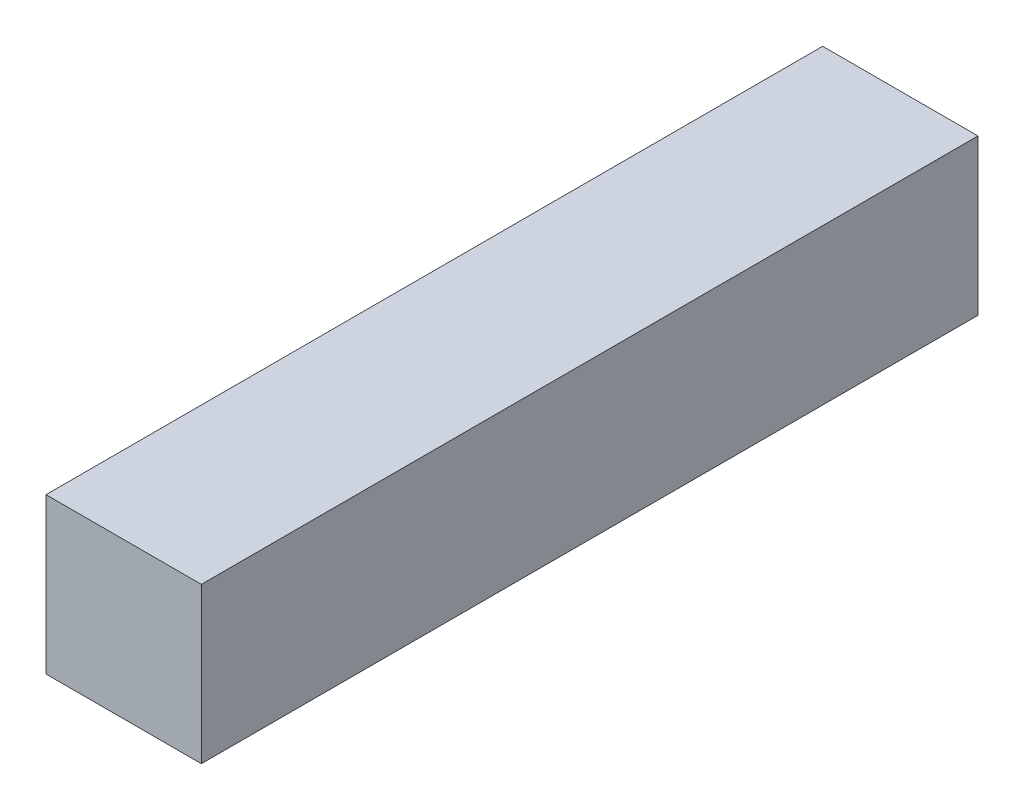
ISO-10303-21;
HEADER;
FILE_DESCRIPTION(('STEP AP214'),'2;1');
FILE_NAME('part.step','',(''),(''),'','','');
FILE_SCHEMA(('AUTOMOTIVE_DESIGN { 1 0 10303 214 1 1 1 1 }'));
ENDSEC;
DATA;
#1=APPLICATION_CONTEXT('core data for automotive mechanical design processes');
#2=APPLICATION_PROTOCOL_DEFINITION('international standard','automotive_design',2000,#1);
#3=PRODUCT_CONTEXT('',#1,'mechanical');
#4=PRODUCT('Part','Part','',(#3));
#5=PRODUCT_RELATED_PRODUCT_CATEGORY('part','',(#4));
#6=PRODUCT_DEFINITION_FORMATION('','',#4);
#7=PRODUCT_DEFINITION_CONTEXT('part definition',#1,'design');
#8=PRODUCT_DEFINITION('design','',#6,#7);
#9=PRODUCT_DEFINITION_SHAPE('','',#8);
#10=(LENGTH_UNIT() NAMED_UNIT(*) SI_UNIT(.MILLI.,.METRE.));
#11=(NAMED_UNIT(*) PLANE_ANGLE_UNIT() SI_UNIT($,.RADIAN.));
#12=(NAMED_UNIT(*) SI_UNIT($,.STERADIAN.) SOLID_ANGLE_UNIT());
#13=UNCERTAINTY_MEASURE_WITH_UNIT(LENGTH_MEASURE(1.E-05),#10,'distance_accuracy_value','');
#14=(GEOMETRIC_REPRESENTATION_CONTEXT(3) GLOBAL_UNCERTAINTY_ASSIGNED_CONTEXT((#13)) GLOBAL_UNIT_ASSIGNED_CONTEXT((#10,
#11,#12)) REPRESENTATION_CONTEXT('',''));
#15=CARTESIAN_POINT('',(0.,0.,0.));
#16=DIRECTION('',(0.,0.,1.));
#17=DIRECTION('',(1.,0.,0.));
#18=AXIS2_PLACEMENT_3D('',#15,#16,#17);
#19=CARTESIAN_POINT('',(2.54,5.08,-12.7));
#20=DIRECTION('',(-1.,0.,0.));
#21=DIRECTION('',(0.,0.,1.));
#22=AXIS2_PLACEMENT_3D('',#19,#20,#21);
#23=PLANE('',#22);
#24=DIRECTION('',(0.,0.,-1.));
#25=VECTOR('',#24,1.);
#26=CARTESIAN_POINT('',(2.54,0.,-12.7));
#27=LINE('',#26,#25);
#28=CARTESIAN_POINT('',(2.54,0.,12.7));
#29=VERTEX_POINT('',#28);
#30=CARTESIAN_POINT('',(2.54,0.,-12.7));
#31=VERTEX_POINT('',#30);
#32=EDGE_CURVE('E107',#29,#31,#27,.T.);
#33=ORIENTED_EDGE('',*,*,#32,.T.);
#34=DIRECTION('',(0.,-1.,0.));
#35=VECTOR('',#34,1.);
#36=CARTESIAN_POINT('',(2.54,5.08,-12.7));
#37=LINE('',#36,#35);
#38=CARTESIAN_POINT('',(2.54,5.08,-12.7));
#39=VERTEX_POINT('',#38);
#40=EDGE_CURVE('E11',#39,#31,#37,.T.);
#41=ORIENTED_EDGE('',*,*,#40,.F.);
#42=DIRECTION('',(0.,0.,-1.));
#43=VECTOR('',#42,1.);
#44=CARTESIAN_POINT('',(2.54,5.08,-12.7));
#45=LINE('',#44,#43);
#46=CARTESIAN_POINT('',(2.54,5.08,12.7));
#47=VERTEX_POINT('',#46);
#48=EDGE_CURVE('E91',#47,#39,#45,.T.);
#49=ORIENTED_EDGE('',*,*,#48,.F.);
#50=DIRECTION('',(0.,-1.,0.));
#51=VECTOR('',#50,1.);
#52=CARTESIAN_POINT('',(2.54,5.08,12.7));
#53=LINE('',#52,#51);
#54=EDGE_CURVE('E103',#47,#29,#53,.T.);
#55=ORIENTED_EDGE('',*,*,#54,.T.);
#56=EDGE_LOOP('',(#33,#41,#49,#55));
#57=FACE_BOUND('',#56,.T.);
#58=ADVANCED_FACE('F39',(#57),#23,.F.);
#59=CARTESIAN_POINT('',(-2.54,5.08,-12.7));
#60=DIRECTION('',(0.,0.,1.));
#61=DIRECTION('',(1.,0.,0.));
#62=AXIS2_PLACEMENT_3D('',#59,#60,#61);
#63=PLANE('',#62);
#64=DIRECTION('',(-1.,0.,0.));
#65=VECTOR('',#64,1.);
#66=CARTESIAN_POINT('',(-2.54,0.,-12.7));
#67=LINE('',#66,#65);
#68=CARTESIAN_POINT('',(-2.54,0.,-12.7));
#69=VERTEX_POINT('',#68);
#70=EDGE_CURVE('E96',#31,#69,#67,.T.);
#71=ORIENTED_EDGE('',*,*,#70,.T.);
#72=DIRECTION('',(0.,-1.,0.));
#73=VECTOR('',#72,1.);
#74=CARTESIAN_POINT('',(-2.54,5.08,-12.7));
#75=LINE('',#74,#73);
#76=CARTESIAN_POINT('',(-2.54,5.08,-12.7));
#77=VERTEX_POINT('',#76);
#78=EDGE_CURVE('E48',#77,#69,#75,.T.);
#79=ORIENTED_EDGE('',*,*,#78,.F.);
#80=DIRECTION('',(-1.,0.,0.));
#81=VECTOR('',#80,1.);
#82=CARTESIAN_POINT('',(-2.54,5.08,-12.7));
#83=LINE('',#82,#81);
#84=EDGE_CURVE('E86',#39,#77,#83,.T.);
#85=ORIENTED_EDGE('',*,*,#84,.F.);
#86=ORIENTED_EDGE('',*,*,#40,.T.);
#87=EDGE_LOOP('',(#71,#79,#85,#86));
#88=FACE_BOUND('',#87,.T.);
#89=ADVANCED_FACE('F95',(#88),#63,.F.);
#90=CARTESIAN_POINT('',(-2.54,5.08,-12.7));
#91=DIRECTION('',(1.,0.,0.));
#92=DIRECTION('',(0.,0.,-1.));
#93=AXIS2_PLACEMENT_3D('',#90,#91,#92);
#94=PLANE('',#93);
#95=DIRECTION('',(0.,0.,1.));
#96=VECTOR('',#95,1.);
#97=CARTESIAN_POINT('',(-2.54,0.,-12.7));
#98=LINE('',#97,#96);
#99=CARTESIAN_POINT('',(-2.54,0.,12.7));
#100=VERTEX_POINT('',#99);
#101=EDGE_CURVE('E73',#69,#100,#98,.T.);
#102=ORIENTED_EDGE('',*,*,#101,.T.);
#103=DIRECTION('',(0.,-1.,0.));
#104=VECTOR('',#103,1.);
#105=CARTESIAN_POINT('',(-2.54,5.08,12.7));
#106=LINE('',#105,#104);
#107=CARTESIAN_POINT('',(-2.54,5.08,12.7));
#108=VERTEX_POINT('',#107);
#109=EDGE_CURVE('E98',#108,#100,#106,.T.);
#110=ORIENTED_EDGE('',*,*,#109,.F.);
#111=DIRECTION('',(0.,0.,1.));
#112=VECTOR('',#111,1.);
#113=CARTESIAN_POINT('',(-2.54,5.08,-12.7));
#114=LINE('',#113,#112);
#115=EDGE_CURVE('E89',#77,#108,#114,.T.);
#116=ORIENTED_EDGE('',*,*,#115,.F.);
#117=ORIENTED_EDGE('',*,*,#78,.T.);
#118=EDGE_LOOP('',(#102,#110,#116,#117));
#119=FACE_BOUND('',#118,.T.);
#120=ADVANCED_FACE('F99',(#119),#94,.F.);
#121=CARTESIAN_POINT('',(-2.54,5.08,12.7));
#122=DIRECTION('',(0.,0.,-1.));
#123=DIRECTION('',(-1.,0.,0.));
#124=AXIS2_PLACEMENT_3D('',#121,#122,#123);
#125=PLANE('',#124);
#126=DIRECTION('',(1.,0.,0.));
#127=VECTOR('',#126,1.);
#128=CARTESIAN_POINT('',(-2.54,0.,12.7));
#129=LINE('',#128,#127);
#130=EDGE_CURVE('E79',#100,#29,#129,.T.);
#131=ORIENTED_EDGE('',*,*,#130,.T.);
#132=ORIENTED_EDGE('',*,*,#54,.F.);
#133=DIRECTION('',(1.,0.,0.));
#134=VECTOR('',#133,1.);
#135=CARTESIAN_POINT('',(-2.54,5.08,12.7));
#136=LINE('',#135,#134);
#137=EDGE_CURVE('E56',#108,#47,#136,.T.);
#138=ORIENTED_EDGE('',*,*,#137,.F.);
#139=ORIENTED_EDGE('',*,*,#109,.T.);
#140=EDGE_LOOP('',(#131,#132,#138,#139));
#141=FACE_BOUND('',#140,.T.);
#142=ADVANCED_FACE('F120',(#141),#125,.F.);
#143=CARTESIAN_POINT('',(0.,5.08,0.));
#144=DIRECTION('',(0.,1.,0.));
#145=DIRECTION('',(0.,0.,1.));
#146=AXIS2_PLACEMENT_3D('',#143,#144,#145);
#147=PLANE('',#146);
#148=ORIENTED_EDGE('',*,*,#48,.T.);
#149=ORIENTED_EDGE('',*,*,#84,.T.);
#150=ORIENTED_EDGE('',*,*,#115,.T.);
#151=ORIENTED_EDGE('',*,*,#137,.T.);
#152=EDGE_LOOP('',(#148,#149,#150,#151));
#153=FACE_BOUND('',#152,.T.);
#154=ADVANCED_FACE('F87',(#153),#147,.T.);
#155=CARTESIAN_POINT('',(0.,0.,0.));
#156=DIRECTION('',(0.,1.,0.));
#157=DIRECTION('',(0.,0.,1.));
#158=AXIS2_PLACEMENT_3D('',#155,#156,#157);
#159=PLANE('',#158);
#160=ORIENTED_EDGE('',*,*,#32,.F.);
#161=ORIENTED_EDGE('',*,*,#130,.F.);
#162=ORIENTED_EDGE('',*,*,#101,.F.);
#163=ORIENTED_EDGE('',*,*,#70,.F.);
#164=EDGE_LOOP('',(#160,#161,#162,#163));
#165=FACE_BOUND('',#164,.T.);
#166=ADVANCED_FACE('F123',(#165),#159,.F.);
#167=CLOSED_SHELL('',(#58,#89,#120,#142,#154,#166));
#168=MANIFOLD_SOLID_BREP('B2',#167);
#169=ADVANCED_BREP_SHAPE_REPRESENTATION('',(#18,#168),#14);
#170=SHAPE_DEFINITION_REPRESENTATION(#9,#169);
ENDSEC;
END-ISO-10303-21;
